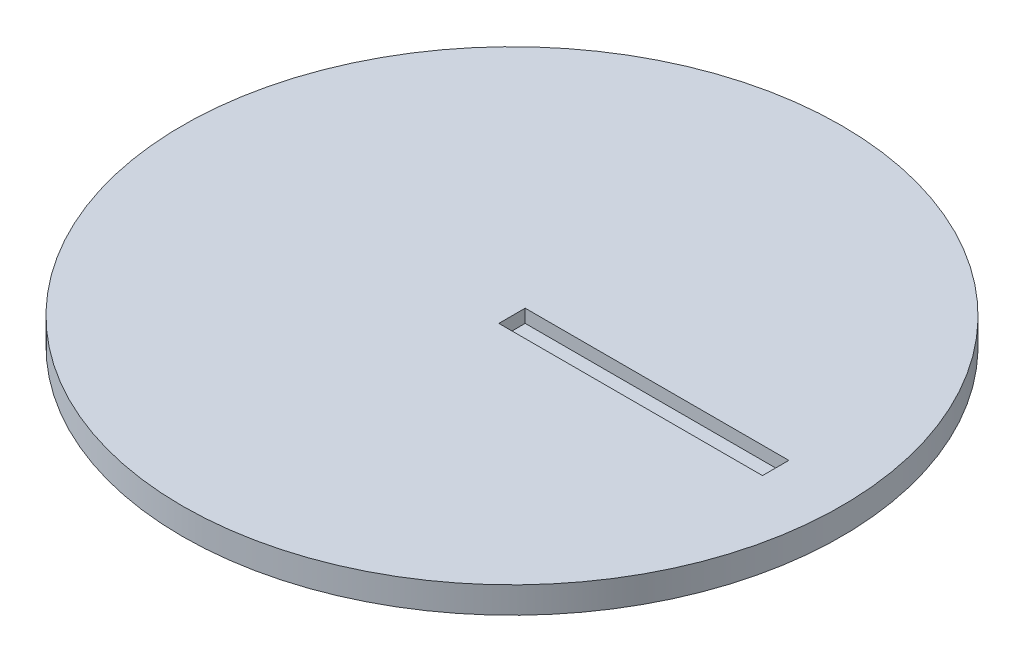
ISO-10303-21;
HEADER;
FILE_DESCRIPTION(('STEP AP214'),'2;1');
FILE_NAME('part.step','',(''),(''),'','','');
FILE_SCHEMA(('AUTOMOTIVE_DESIGN { 1 0 10303 214 1 1 1 1 }'));
ENDSEC;
DATA;
#1=APPLICATION_CONTEXT('core data for automotive mechanical design processes');
#2=APPLICATION_PROTOCOL_DEFINITION('international standard','automotive_design',2000,#1);
#3=PRODUCT_CONTEXT('',#1,'mechanical');
#4=PRODUCT('Part','Part','',(#3));
#5=PRODUCT_RELATED_PRODUCT_CATEGORY('part','',(#4));
#6=PRODUCT_DEFINITION_FORMATION('','',#4);
#7=PRODUCT_DEFINITION_CONTEXT('part definition',#1,'design');
#8=PRODUCT_DEFINITION('design','',#6,#7);
#9=PRODUCT_DEFINITION_SHAPE('','',#8);
#10=(LENGTH_UNIT() NAMED_UNIT(*) SI_UNIT(.MILLI.,.METRE.));
#11=(NAMED_UNIT(*) PLANE_ANGLE_UNIT() SI_UNIT($,.RADIAN.));
#12=(NAMED_UNIT(*) SI_UNIT($,.STERADIAN.) SOLID_ANGLE_UNIT());
#13=UNCERTAINTY_MEASURE_WITH_UNIT(LENGTH_MEASURE(1.E-05),#10,'distance_accuracy_value','');
#14=(GEOMETRIC_REPRESENTATION_CONTEXT(3) GLOBAL_UNCERTAINTY_ASSIGNED_CONTEXT((#13)) GLOBAL_UNIT_ASSIGNED_CONTEXT((#10,
#11,#12)) REPRESENTATION_CONTEXT('',''));
#15=CARTESIAN_POINT('',(0.,0.,0.));
#16=DIRECTION('',(0.,0.,1.));
#17=DIRECTION('',(1.,0.,0.));
#18=AXIS2_PLACEMENT_3D('',#15,#16,#17);
#19=CARTESIAN_POINT('',(0.,2.,0.));
#20=DIRECTION('',(0.,1.,0.));
#21=DIRECTION('',(0.,0.,1.));
#22=AXIS2_PLACEMENT_3D('',#19,#20,#21);
#23=PLANE('',#22);
#24=CARTESIAN_POINT('',(0.,2.,0.));
#25=DIRECTION('',(0.,1.,0.));
#26=DIRECTION('',(0.,0.,1.));
#27=AXIS2_PLACEMENT_3D('',#24,#25,#26);
#28=CIRCLE('',#27,25.);
#29=CARTESIAN_POINT('',(0.,2.,25.));
#30=VERTEX_POINT('',#29);
#31=EDGE_CURVE('E101',#30,#30,#28,.T.);
#32=ORIENTED_EDGE('',*,*,#31,.T.);
#33=EDGE_LOOP('',(#32));
#34=FACE_BOUND('',#33,.T.);
#35=DIRECTION('',(0.,0.,-1.));
#36=VECTOR('',#35,1.);
#37=CARTESIAN_POINT('',(20.,2.,0.));
#38=LINE('',#37,#36);
#39=CARTESIAN_POINT('',(20.,2.,1.));
#40=VERTEX_POINT('',#39);
#41=CARTESIAN_POINT('',(20.,2.,-1.));
#42=VERTEX_POINT('',#41);
#43=EDGE_CURVE('E41',#40,#42,#38,.T.);
#44=ORIENTED_EDGE('',*,*,#43,.F.);
#45=DIRECTION('',(-1.,0.,0.));
#46=VECTOR('',#45,1.);
#47=CARTESIAN_POINT('',(0.,2.,1.));
#48=LINE('',#47,#46);
#49=CARTESIAN_POINT('',(0.,2.,1.));
#50=VERTEX_POINT('',#49);
#51=EDGE_CURVE('E11',#40,#50,#48,.T.);
#52=ORIENTED_EDGE('',*,*,#51,.T.);
#53=DIRECTION('',(0.,0.,1.));
#54=VECTOR('',#53,1.);
#55=CARTESIAN_POINT('',(0.,2.,0.));
#56=LINE('',#55,#54);
#57=CARTESIAN_POINT('',(0.,2.,-1.));
#58=VERTEX_POINT('',#57);
#59=EDGE_CURVE('E104',#58,#50,#56,.T.);
#60=ORIENTED_EDGE('',*,*,#59,.F.);
#61=DIRECTION('',(-1.,0.,0.));
#62=VECTOR('',#61,1.);
#63=CARTESIAN_POINT('',(0.,2.,-1.));
#64=LINE('',#63,#62);
#65=EDGE_CURVE('E108',#42,#58,#64,.T.);
#66=ORIENTED_EDGE('',*,*,#65,.F.);
#67=EDGE_LOOP('',(#44,#52,#60,#66));
#68=FACE_BOUND('',#67,.T.);
#69=ADVANCED_FACE('F33',(#34,#68),#23,.T.);
#70=CARTESIAN_POINT('',(0.,2.,0.));
#71=DIRECTION('',(0.,-1.,0.));
#72=DIRECTION('',(0.,0.,-1.));
#73=AXIS2_PLACEMENT_3D('',#70,#71,#72);
#74=CYLINDRICAL_SURFACE('',#73,25.);
#75=ORIENTED_EDGE('',*,*,#31,.F.);
#76=EDGE_LOOP('',(#75));
#77=FACE_BOUND('',#76,.T.);
#78=CARTESIAN_POINT('',(0.,0.,0.));
#79=DIRECTION('',(0.,1.,0.));
#80=DIRECTION('',(0.,0.,1.));
#81=AXIS2_PLACEMENT_3D('',#78,#79,#80);
#82=CIRCLE('',#81,25.);
#83=CARTESIAN_POINT('',(0.,0.,25.));
#84=VERTEX_POINT('',#83);
#85=EDGE_CURVE('E78',#84,#84,#82,.T.);
#86=ORIENTED_EDGE('',*,*,#85,.T.);
#87=EDGE_LOOP('',(#86));
#88=FACE_BOUND('',#87,.T.);
#89=ADVANCED_FACE('F35',(#77,#88),#74,.T.);
#90=CARTESIAN_POINT('',(0.,0.,0.));
#91=DIRECTION('',(0.,1.,0.));
#92=DIRECTION('',(0.,0.,1.));
#93=AXIS2_PLACEMENT_3D('',#90,#91,#92);
#94=PLANE('',#93);
#95=ORIENTED_EDGE('',*,*,#85,.F.);
#96=EDGE_LOOP('',(#95));
#97=FACE_BOUND('',#96,.T.);
#98=ADVANCED_FACE('F129',(#97),#94,.F.);
#99=CARTESIAN_POINT('',(0.,2.000012,1.));
#100=DIRECTION('',(0.,0.,-1.));
#101=DIRECTION('',(-1.,0.,0.));
#102=AXIS2_PLACEMENT_3D('',#99,#100,#101);
#103=PLANE('',#102);
#104=DIRECTION('',(0.,-1.,0.));
#105=VECTOR('',#104,1.);
#106=CARTESIAN_POINT('',(20.,2.000012,1.));
#107=LINE('',#106,#105);
#108=CARTESIAN_POINT('',(20.,1.,1.));
#109=VERTEX_POINT('',#108);
#110=EDGE_CURVE('E71',#40,#109,#107,.T.);
#111=ORIENTED_EDGE('',*,*,#110,.T.);
#112=DIRECTION('',(1.,0.,0.));
#113=VECTOR('',#112,1.);
#114=CARTESIAN_POINT('',(0.,1.,1.));
#115=LINE('',#114,#113);
#116=CARTESIAN_POINT('',(0.,1.,1.));
#117=VERTEX_POINT('',#116);
#118=EDGE_CURVE('E75',#117,#109,#115,.T.);
#119=ORIENTED_EDGE('',*,*,#118,.F.);
#120=DIRECTION('',(0.,-1.,0.));
#121=VECTOR('',#120,1.);
#122=CARTESIAN_POINT('',(0.,2.000012,1.));
#123=LINE('',#122,#121);
#124=EDGE_CURVE('E97',#50,#117,#123,.T.);
#125=ORIENTED_EDGE('',*,*,#124,.F.);
#126=ORIENTED_EDGE('',*,*,#51,.F.);
#127=EDGE_LOOP('',(#111,#119,#125,#126));
#128=FACE_BOUND('',#127,.T.);
#129=ADVANCED_FACE('F73',(#128),#103,.T.);
#130=CARTESIAN_POINT('',(20.,2.000012,-1.));
#131=DIRECTION('',(1.,0.,0.));
#132=DIRECTION('',(0.,0.,-1.));
#133=AXIS2_PLACEMENT_3D('',#130,#131,#132);
#134=PLANE('',#133);
#135=ORIENTED_EDGE('',*,*,#43,.T.);
#136=DIRECTION('',(0.,-1.,0.));
#137=VECTOR('',#136,1.);
#138=CARTESIAN_POINT('',(20.,2.000012,-1.));
#139=LINE('',#138,#137);
#140=CARTESIAN_POINT('',(20.,1.,-1.));
#141=VERTEX_POINT('',#140);
#142=EDGE_CURVE('E79',#42,#141,#139,.T.);
#143=ORIENTED_EDGE('',*,*,#142,.T.);
#144=DIRECTION('',(0.,0.,1.));
#145=VECTOR('',#144,1.);
#146=CARTESIAN_POINT('',(20.,1.,-1.));
#147=LINE('',#146,#145);
#148=EDGE_CURVE('E82',#141,#109,#147,.T.);
#149=ORIENTED_EDGE('',*,*,#148,.T.);
#150=ORIENTED_EDGE('',*,*,#110,.F.);
#151=EDGE_LOOP('',(#135,#143,#149,#150));
#152=FACE_BOUND('',#151,.T.);
#153=ADVANCED_FACE('F83',(#152),#134,.F.);
#154=CARTESIAN_POINT('',(0.,2.000012,-1.));
#155=DIRECTION('',(0.,0.,-1.));
#156=DIRECTION('',(-1.,0.,0.));
#157=AXIS2_PLACEMENT_3D('',#154,#155,#156);
#158=PLANE('',#157);
#159=ORIENTED_EDGE('',*,*,#65,.T.);
#160=DIRECTION('',(0.,-1.,0.));
#161=VECTOR('',#160,1.);
#162=CARTESIAN_POINT('',(0.,2.000012,-1.));
#163=LINE('',#162,#161);
#164=CARTESIAN_POINT('',(0.,1.,-1.));
#165=VERTEX_POINT('',#164);
#166=EDGE_CURVE('E48',#58,#165,#163,.T.);
#167=ORIENTED_EDGE('',*,*,#166,.T.);
#168=DIRECTION('',(1.,0.,0.));
#169=VECTOR('',#168,1.);
#170=CARTESIAN_POINT('',(0.,1.,-1.));
#171=LINE('',#170,#169);
#172=EDGE_CURVE('E88',#165,#141,#171,.T.);
#173=ORIENTED_EDGE('',*,*,#172,.T.);
#174=ORIENTED_EDGE('',*,*,#142,.F.);
#175=EDGE_LOOP('',(#159,#167,#173,#174));
#176=FACE_BOUND('',#175,.T.);
#177=ADVANCED_FACE('F112',(#176),#158,.F.);
#178=CARTESIAN_POINT('',(0.,2.000012,1.));
#179=DIRECTION('',(-1.,0.,0.));
#180=DIRECTION('',(0.,0.,1.));
#181=AXIS2_PLACEMENT_3D('',#178,#179,#180);
#182=PLANE('',#181);
#183=ORIENTED_EDGE('',*,*,#59,.T.);
#184=ORIENTED_EDGE('',*,*,#124,.T.);
#185=DIRECTION('',(0.,0.,-1.));
#186=VECTOR('',#185,1.);
#187=CARTESIAN_POINT('',(0.,1.,1.));
#188=LINE('',#187,#186);
#189=EDGE_CURVE('E92',#117,#165,#188,.T.);
#190=ORIENTED_EDGE('',*,*,#189,.T.);
#191=ORIENTED_EDGE('',*,*,#166,.F.);
#192=EDGE_LOOP('',(#183,#184,#190,#191));
#193=FACE_BOUND('',#192,.T.);
#194=ADVANCED_FACE('F114',(#193),#182,.F.);
#195=CARTESIAN_POINT('',(0.,1.,0.));
#196=DIRECTION('',(0.,-1.,0.));
#197=DIRECTION('',(-1.,0.,0.));
#198=AXIS2_PLACEMENT_3D('',#195,#196,#197);
#199=PLANE('',#198);
#200=ORIENTED_EDGE('',*,*,#118,.T.);
#201=ORIENTED_EDGE('',*,*,#148,.F.);
#202=ORIENTED_EDGE('',*,*,#172,.F.);
#203=ORIENTED_EDGE('',*,*,#189,.F.);
#204=EDGE_LOOP('',(#200,#201,#202,#203));
#205=FACE_BOUND('',#204,.T.);
#206=ADVANCED_FACE('F91',(#205),#199,.F.);
#207=CLOSED_SHELL('',(#69,#89,#98,#129,#153,#177,#194,#206));
#208=MANIFOLD_SOLID_BREP('B2',#207);
#209=ADVANCED_BREP_SHAPE_REPRESENTATION('',(#18,#208),#14);
#210=SHAPE_DEFINITION_REPRESENTATION(#9,#209);
ENDSEC;
END-ISO-10303-21;
